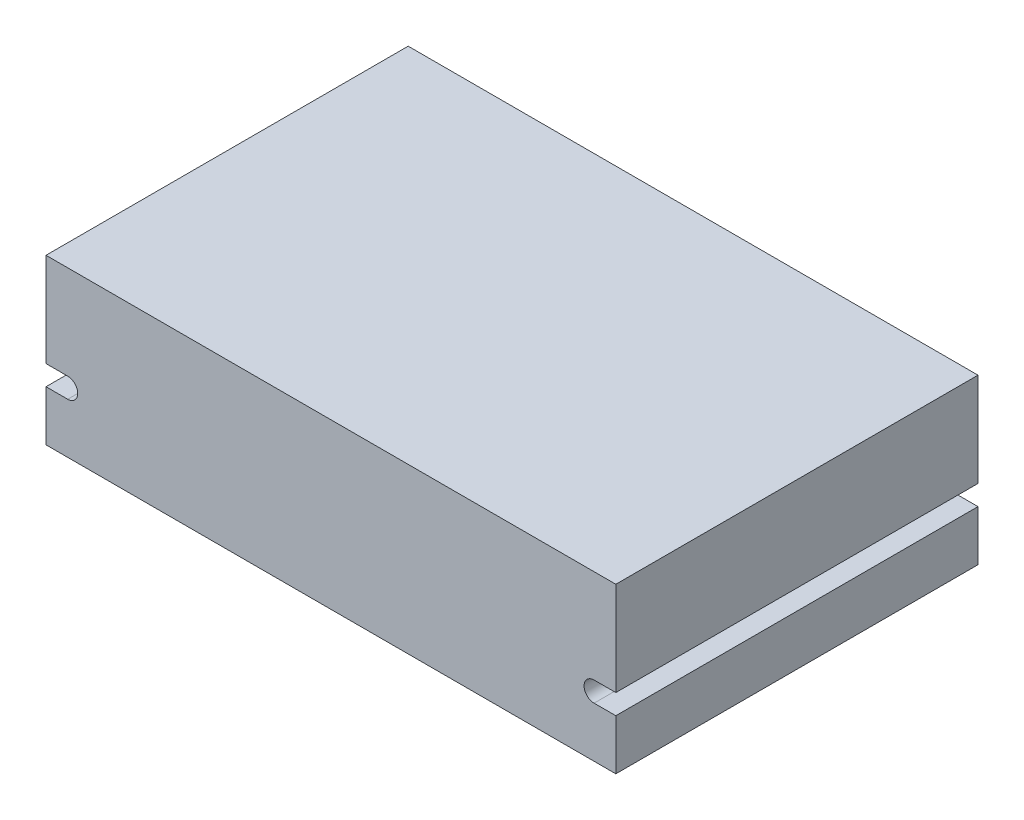
ISO-10303-21;
HEADER;
FILE_DESCRIPTION(('STEP AP214'),'2;1');
FILE_NAME('part.step','',(''),(''),'','','');
FILE_SCHEMA(('AUTOMOTIVE_DESIGN { 1 0 10303 214 1 1 1 1 }'));
ENDSEC;
DATA;
#1=APPLICATION_CONTEXT('core data for automotive mechanical design processes');
#2=APPLICATION_PROTOCOL_DEFINITION('international standard','automotive_design',2000,#1);
#3=PRODUCT_CONTEXT('',#1,'mechanical');
#4=PRODUCT('Part','Part','',(#3));
#5=PRODUCT_RELATED_PRODUCT_CATEGORY('part','',(#4));
#6=PRODUCT_DEFINITION_FORMATION('','',#4);
#7=PRODUCT_DEFINITION_CONTEXT('part definition',#1,'design');
#8=PRODUCT_DEFINITION('design','',#6,#7);
#9=PRODUCT_DEFINITION_SHAPE('','',#8);
#10=(LENGTH_UNIT() NAMED_UNIT(*) SI_UNIT(.MILLI.,.METRE.));
#11=(NAMED_UNIT(*) PLANE_ANGLE_UNIT() SI_UNIT($,.RADIAN.));
#12=(NAMED_UNIT(*) SI_UNIT($,.STERADIAN.) SOLID_ANGLE_UNIT());
#13=UNCERTAINTY_MEASURE_WITH_UNIT(LENGTH_MEASURE(1.E-05),#10,'distance_accuracy_value','');
#14=(GEOMETRIC_REPRESENTATION_CONTEXT(3) GLOBAL_UNCERTAINTY_ASSIGNED_CONTEXT((#13)) GLOBAL_UNIT_ASSIGNED_CONTEXT((#10,
#11,#12)) REPRESENTATION_CONTEXT('',''));
#15=CARTESIAN_POINT('',(0.,0.,0.));
#16=DIRECTION('',(0.,0.,1.));
#17=DIRECTION('',(1.,0.,0.));
#18=AXIS2_PLACEMENT_3D('',#15,#16,#17);
#19=CARTESIAN_POINT('',(-56.75,17.,75.));
#20=DIRECTION('',(1.,0.,0.));
#21=DIRECTION('',(0.,0.,-1.));
#22=AXIS2_PLACEMENT_3D('',#19,#20,#21);
#23=PLANE('',#22);
#24=DIRECTION('',(0.,-1.,0.));
#25=VECTOR('',#24,1.);
#26=CARTESIAN_POINT('',(-56.75,17.,0.));
#27=LINE('',#26,#25);
#28=CARTESIAN_POINT('',(-56.75,17.,0.));
#29=VERTEX_POINT('',#28);
#30=CARTESIAN_POINT('',(-56.75,-2.42677328176177,0.));
#31=VERTEX_POINT('',#30);
#32=EDGE_CURVE('E152',#29,#31,#27,.T.);
#33=ORIENTED_EDGE('',*,*,#32,.T.);
#34=DIRECTION('',(0.,0.,-1.));
#35=VECTOR('',#34,1.);
#36=CARTESIAN_POINT('',(-56.75,-2.42677328176177,75.));
#37=LINE('',#36,#35);
#38=CARTESIAN_POINT('',(-56.75,-2.42677328176177,75.));
#39=VERTEX_POINT('',#38);
#40=EDGE_CURVE('E11',#39,#31,#37,.T.);
#41=ORIENTED_EDGE('',*,*,#40,.F.);
#42=DIRECTION('',(0.,-1.,0.));
#43=VECTOR('',#42,1.);
#44=CARTESIAN_POINT('',(-56.75,17.,75.));
#45=LINE('',#44,#43);
#46=CARTESIAN_POINT('',(-56.75,17.,75.));
#47=VERTEX_POINT('',#46);
#48=EDGE_CURVE('E174',#47,#39,#45,.T.);
#49=ORIENTED_EDGE('',*,*,#48,.F.);
#50=DIRECTION('',(0.,0.,-1.));
#51=VECTOR('',#50,1.);
#52=CARTESIAN_POINT('',(-56.75,17.,75.));
#53=LINE('',#52,#51);
#54=EDGE_CURVE('E148',#47,#29,#53,.T.);
#55=ORIENTED_EDGE('',*,*,#54,.T.);
#56=EDGE_LOOP('',(#33,#41,#49,#55));
#57=FACE_BOUND('',#56,.T.);
#58=ADVANCED_FACE('F32',(#57),#23,.F.);
#59=CARTESIAN_POINT('',(-56.75,-2.42677328176177,75.));
#60=DIRECTION('',(0.,1.,0.));
#61=DIRECTION('',(0.,0.,1.));
#62=AXIS2_PLACEMENT_3D('',#59,#60,#61);
#63=PLANE('',#62);
#64=DIRECTION('',(1.,0.,0.));
#65=VECTOR('',#64,1.);
#66=CARTESIAN_POINT('',(-56.75,-2.42677328176177,0.));
#67=LINE('',#66,#65);
#68=CARTESIAN_POINT('',(-52.25,-2.42677328176177,0.));
#69=VERTEX_POINT('',#68);
#70=EDGE_CURVE('E155',#31,#69,#67,.T.);
#71=ORIENTED_EDGE('',*,*,#70,.T.);
#72=DIRECTION('',(0.,0.,-1.));
#73=VECTOR('',#72,1.);
#74=CARTESIAN_POINT('',(-52.25,-2.42677328176177,75.));
#75=LINE('',#74,#73);
#76=CARTESIAN_POINT('',(-52.25,-2.42677328176177,75.));
#77=VERTEX_POINT('',#76);
#78=EDGE_CURVE('E40',#77,#69,#75,.T.);
#79=ORIENTED_EDGE('',*,*,#78,.F.);
#80=DIRECTION('',(1.,0.,0.));
#81=VECTOR('',#80,1.);
#82=CARTESIAN_POINT('',(-56.75,-2.42677328176177,75.));
#83=LINE('',#82,#81);
#84=EDGE_CURVE('E103',#39,#77,#83,.T.);
#85=ORIENTED_EDGE('',*,*,#84,.F.);
#86=ORIENTED_EDGE('',*,*,#40,.T.);
#87=EDGE_LOOP('',(#71,#79,#85,#86));
#88=FACE_BOUND('',#87,.T.);
#89=ADVANCED_FACE('F252',(#88),#63,.F.);
#90=CARTESIAN_POINT('',(-52.25,-4.49999999999995,75.));
#91=DIRECTION('',(0.,0.,-1.));
#92=DIRECTION('',(-1.,0.,0.));
#93=AXIS2_PLACEMENT_3D('',#90,#91,#92);
#94=CYLINDRICAL_SURFACE('',#93,2.07322671823817);
#95=CARTESIAN_POINT('',(-52.25,-4.49999999999995,0.));
#96=DIRECTION('',(0.,0.,-1.));
#97=DIRECTION('',(1.,0.,0.));
#98=AXIS2_PLACEMENT_3D('',#95,#96,#97);
#99=CIRCLE('',#98,2.07322671823817);
#100=CARTESIAN_POINT('',(-52.25,-6.57322671823812,0.));
#101=VERTEX_POINT('',#100);
#102=EDGE_CURVE('E157',#69,#101,#99,.T.);
#103=ORIENTED_EDGE('',*,*,#102,.T.);
#104=DIRECTION('',(0.,0.,-1.));
#105=VECTOR('',#104,1.);
#106=CARTESIAN_POINT('',(-52.25,-6.57322671823812,75.));
#107=LINE('',#106,#105);
#108=CARTESIAN_POINT('',(-52.25,-6.57322671823812,75.));
#109=VERTEX_POINT('',#108);
#110=EDGE_CURVE('E193',#109,#101,#107,.T.);
#111=ORIENTED_EDGE('',*,*,#110,.F.);
#112=CARTESIAN_POINT('',(-52.25,-4.49999999999995,75.));
#113=DIRECTION('',(0.,0.,-1.));
#114=DIRECTION('',(1.,0.,0.));
#115=AXIS2_PLACEMENT_3D('',#112,#113,#114);
#116=CIRCLE('',#115,2.07322671823817);
#117=EDGE_CURVE('E201',#77,#109,#116,.T.);
#118=ORIENTED_EDGE('',*,*,#117,.F.);
#119=ORIENTED_EDGE('',*,*,#78,.T.);
#120=EDGE_LOOP('',(#103,#111,#118,#119));
#121=FACE_BOUND('',#120,.T.);
#122=ADVANCED_FACE('F199',(#121),#94,.F.);
#123=CARTESIAN_POINT('',(-56.75,-6.57322671823812,75.));
#124=DIRECTION('',(0.,-1.,0.));
#125=DIRECTION('',(0.,0.,-1.));
#126=AXIS2_PLACEMENT_3D('',#123,#124,#125);
#127=PLANE('',#126);
#128=DIRECTION('',(-1.,0.,0.));
#129=VECTOR('',#128,1.);
#130=CARTESIAN_POINT('',(-56.75,-6.57322671823812,0.));
#131=LINE('',#130,#129);
#132=CARTESIAN_POINT('',(-56.75,-6.57322671823812,0.));
#133=VERTEX_POINT('',#132);
#134=EDGE_CURVE('E159',#101,#133,#131,.T.);
#135=ORIENTED_EDGE('',*,*,#134,.T.);
#136=DIRECTION('',(0.,0.,-1.));
#137=VECTOR('',#136,1.);
#138=CARTESIAN_POINT('',(-56.75,-6.57322671823812,75.));
#139=LINE('',#138,#137);
#140=CARTESIAN_POINT('',(-56.75,-6.57322671823812,75.));
#141=VERTEX_POINT('',#140);
#142=EDGE_CURVE('E190',#141,#133,#139,.T.);
#143=ORIENTED_EDGE('',*,*,#142,.F.);
#144=DIRECTION('',(-1.,0.,0.));
#145=VECTOR('',#144,1.);
#146=CARTESIAN_POINT('',(-56.75,-6.57322671823812,75.));
#147=LINE('',#146,#145);
#148=EDGE_CURVE('E219',#109,#141,#147,.T.);
#149=ORIENTED_EDGE('',*,*,#148,.F.);
#150=ORIENTED_EDGE('',*,*,#110,.T.);
#151=EDGE_LOOP('',(#135,#143,#149,#150));
#152=FACE_BOUND('',#151,.T.);
#153=ADVANCED_FACE('F210',(#152),#127,.F.);
#154=CARTESIAN_POINT('',(-56.75,-6.57322671823812,75.));
#155=DIRECTION('',(1.,0.,0.));
#156=DIRECTION('',(0.,0.,-1.));
#157=AXIS2_PLACEMENT_3D('',#154,#155,#156);
#158=PLANE('',#157);
#159=DIRECTION('',(0.,-1.,0.));
#160=VECTOR('',#159,1.);
#161=CARTESIAN_POINT('',(-56.75,-6.57322671823812,0.));
#162=LINE('',#161,#160);
#163=CARTESIAN_POINT('',(-56.75,-17.,0.));
#164=VERTEX_POINT('',#163);
#165=EDGE_CURVE('E161',#133,#164,#162,.T.);
#166=ORIENTED_EDGE('',*,*,#165,.T.);
#167=DIRECTION('',(0.,0.,-1.));
#168=VECTOR('',#167,1.);
#169=CARTESIAN_POINT('',(-56.75,-17.,75.));
#170=LINE('',#169,#168);
#171=CARTESIAN_POINT('',(-56.75,-17.,75.));
#172=VERTEX_POINT('',#171);
#173=EDGE_CURVE('E187',#172,#164,#170,.T.);
#174=ORIENTED_EDGE('',*,*,#173,.F.);
#175=DIRECTION('',(0.,-1.,0.));
#176=VECTOR('',#175,1.);
#177=CARTESIAN_POINT('',(-56.75,-6.57322671823812,75.));
#178=LINE('',#177,#176);
#179=EDGE_CURVE('E216',#141,#172,#178,.T.);
#180=ORIENTED_EDGE('',*,*,#179,.F.);
#181=ORIENTED_EDGE('',*,*,#142,.T.);
#182=EDGE_LOOP('',(#166,#174,#180,#181));
#183=FACE_BOUND('',#182,.T.);
#184=ADVANCED_FACE('F214',(#183),#158,.F.);
#185=CARTESIAN_POINT('',(-56.75,-17.,75.));
#186=DIRECTION('',(0.,1.,0.));
#187=DIRECTION('',(0.,0.,1.));
#188=AXIS2_PLACEMENT_3D('',#185,#186,#187);
#189=PLANE('',#188);
#190=DIRECTION('',(1.,0.,0.));
#191=VECTOR('',#190,1.);
#192=CARTESIAN_POINT('',(-56.75,-17.,0.));
#193=LINE('',#192,#191);
#194=CARTESIAN_POINT('',(61.25,-17.,0.));
#195=VERTEX_POINT('',#194);
#196=EDGE_CURVE('E163',#164,#195,#193,.T.);
#197=ORIENTED_EDGE('',*,*,#196,.T.);
#198=DIRECTION('',(0.,0.,-1.));
#199=VECTOR('',#198,1.);
#200=CARTESIAN_POINT('',(61.25,-17.,75.));
#201=LINE('',#200,#199);
#202=CARTESIAN_POINT('',(61.25,-17.,75.));
#203=VERTEX_POINT('',#202);
#204=EDGE_CURVE('E184',#203,#195,#201,.T.);
#205=ORIENTED_EDGE('',*,*,#204,.F.);
#206=DIRECTION('',(1.,0.,0.));
#207=VECTOR('',#206,1.);
#208=CARTESIAN_POINT('',(-56.75,-17.,75.));
#209=LINE('',#208,#207);
#210=EDGE_CURVE('E218',#172,#203,#209,.T.);
#211=ORIENTED_EDGE('',*,*,#210,.F.);
#212=ORIENTED_EDGE('',*,*,#173,.T.);
#213=EDGE_LOOP('',(#197,#205,#211,#212));
#214=FACE_BOUND('',#213,.T.);
#215=ADVANCED_FACE('F265',(#214),#189,.F.);
#216=CARTESIAN_POINT('',(61.25,-6.57322671823812,75.));
#217=DIRECTION('',(-1.,0.,0.));
#218=DIRECTION('',(0.,0.,1.));
#219=AXIS2_PLACEMENT_3D('',#216,#217,#218);
#220=PLANE('',#219);
#221=DIRECTION('',(0.,1.,0.));
#222=VECTOR('',#221,1.);
#223=CARTESIAN_POINT('',(61.25,-6.57322671823812,0.));
#224=LINE('',#223,#222);
#225=CARTESIAN_POINT('',(61.25,-6.57322671823812,0.));
#226=VERTEX_POINT('',#225);
#227=EDGE_CURVE('E165',#195,#226,#224,.T.);
#228=ORIENTED_EDGE('',*,*,#227,.T.);
#229=DIRECTION('',(0.,0.,-1.));
#230=VECTOR('',#229,1.);
#231=CARTESIAN_POINT('',(61.25,-6.57322671823812,75.));
#232=LINE('',#231,#230);
#233=CARTESIAN_POINT('',(61.25,-6.57322671823812,75.));
#234=VERTEX_POINT('',#233);
#235=EDGE_CURVE('E181',#234,#226,#232,.T.);
#236=ORIENTED_EDGE('',*,*,#235,.F.);
#237=DIRECTION('',(0.,1.,0.));
#238=VECTOR('',#237,1.);
#239=CARTESIAN_POINT('',(61.25,-6.57322671823812,75.));
#240=LINE('',#239,#238);
#241=EDGE_CURVE('E221',#203,#234,#240,.T.);
#242=ORIENTED_EDGE('',*,*,#241,.F.);
#243=ORIENTED_EDGE('',*,*,#204,.T.);
#244=EDGE_LOOP('',(#228,#236,#242,#243));
#245=FACE_BOUND('',#244,.T.);
#246=ADVANCED_FACE('F268',(#245),#220,.F.);
#247=CARTESIAN_POINT('',(61.25,-6.57322671823812,75.));
#248=DIRECTION('',(0.,-1.,0.));
#249=DIRECTION('',(0.,0.,-1.));
#250=AXIS2_PLACEMENT_3D('',#247,#248,#249);
#251=PLANE('',#250);
#252=DIRECTION('',(-1.,0.,0.));
#253=VECTOR('',#252,1.);
#254=CARTESIAN_POINT('',(61.25,-6.57322671823812,0.));
#255=LINE('',#254,#253);
#256=CARTESIAN_POINT('',(56.75,-6.57322671823812,0.));
#257=VERTEX_POINT('',#256);
#258=EDGE_CURVE('E167',#226,#257,#255,.T.);
#259=ORIENTED_EDGE('',*,*,#258,.T.);
#260=DIRECTION('',(0.,0.,-1.));
#261=VECTOR('',#260,1.);
#262=CARTESIAN_POINT('',(56.75,-6.57322671823812,75.));
#263=LINE('',#262,#261);
#264=CARTESIAN_POINT('',(56.75,-6.57322671823812,75.));
#265=VERTEX_POINT('',#264);
#266=EDGE_CURVE('E178',#265,#257,#263,.T.);
#267=ORIENTED_EDGE('',*,*,#266,.F.);
#268=DIRECTION('',(-1.,0.,0.));
#269=VECTOR('',#268,1.);
#270=CARTESIAN_POINT('',(61.25,-6.57322671823812,75.));
#271=LINE('',#270,#269);
#272=EDGE_CURVE('E227',#234,#265,#271,.T.);
#273=ORIENTED_EDGE('',*,*,#272,.F.);
#274=ORIENTED_EDGE('',*,*,#235,.T.);
#275=EDGE_LOOP('',(#259,#267,#273,#274));
#276=FACE_BOUND('',#275,.T.);
#277=ADVANCED_FACE('F233',(#276),#251,.F.);
#278=CARTESIAN_POINT('',(56.75,-4.49999999999995,75.));
#279=DIRECTION('',(0.,0.,-1.));
#280=DIRECTION('',(-1.,0.,0.));
#281=AXIS2_PLACEMENT_3D('',#278,#279,#280);
#282=CYLINDRICAL_SURFACE('',#281,2.07322671823817);
#283=CARTESIAN_POINT('',(56.75,-4.49999999999995,0.));
#284=DIRECTION('',(0.,0.,-1.));
#285=DIRECTION('',(-1.,0.,0.));
#286=AXIS2_PLACEMENT_3D('',#283,#284,#285);
#287=CIRCLE('',#286,2.07322671823817);
#288=CARTESIAN_POINT('',(56.75,-2.42677328176177,0.));
#289=VERTEX_POINT('',#288);
#290=EDGE_CURVE('E169',#257,#289,#287,.T.);
#291=ORIENTED_EDGE('',*,*,#290,.T.);
#292=DIRECTION('',(0.,0.,-1.));
#293=VECTOR('',#292,1.);
#294=CARTESIAN_POINT('',(56.75,-2.42677328176177,75.));
#295=LINE('',#294,#293);
#296=CARTESIAN_POINT('',(56.75,-2.42677328176177,75.));
#297=VERTEX_POINT('',#296);
#298=EDGE_CURVE('E143',#297,#289,#295,.T.);
#299=ORIENTED_EDGE('',*,*,#298,.F.);
#300=CARTESIAN_POINT('',(56.75,-4.49999999999995,75.));
#301=DIRECTION('',(0.,0.,-1.));
#302=DIRECTION('',(-1.,0.,0.));
#303=AXIS2_PLACEMENT_3D('',#300,#301,#302);
#304=CIRCLE('',#303,2.07322671823817);
#305=EDGE_CURVE('E134',#265,#297,#304,.T.);
#306=ORIENTED_EDGE('',*,*,#305,.F.);
#307=ORIENTED_EDGE('',*,*,#266,.T.);
#308=EDGE_LOOP('',(#291,#299,#306,#307));
#309=FACE_BOUND('',#308,.T.);
#310=ADVANCED_FACE('F237',(#309),#282,.F.);
#311=CARTESIAN_POINT('',(61.25,-2.42677328176177,75.));
#312=DIRECTION('',(0.,1.,0.));
#313=DIRECTION('',(0.,0.,1.));
#314=AXIS2_PLACEMENT_3D('',#311,#312,#313);
#315=PLANE('',#314);
#316=DIRECTION('',(1.,0.,0.));
#317=VECTOR('',#316,1.);
#318=CARTESIAN_POINT('',(61.25,-2.42677328176177,0.));
#319=LINE('',#318,#317);
#320=CARTESIAN_POINT('',(61.25,-2.42677328176177,0.));
#321=VERTEX_POINT('',#320);
#322=EDGE_CURVE('E142',#289,#321,#319,.T.);
#323=ORIENTED_EDGE('',*,*,#322,.T.);
#324=DIRECTION('',(0.,0.,-1.));
#325=VECTOR('',#324,1.);
#326=CARTESIAN_POINT('',(61.25,-2.42677328176177,75.));
#327=LINE('',#326,#325);
#328=CARTESIAN_POINT('',(61.25,-2.42677328176177,75.));
#329=VERTEX_POINT('',#328);
#330=EDGE_CURVE('E139',#329,#321,#327,.T.);
#331=ORIENTED_EDGE('',*,*,#330,.F.);
#332=DIRECTION('',(1.,0.,0.));
#333=VECTOR('',#332,1.);
#334=CARTESIAN_POINT('',(61.25,-2.42677328176177,75.));
#335=LINE('',#334,#333);
#336=EDGE_CURVE('E128',#297,#329,#335,.T.);
#337=ORIENTED_EDGE('',*,*,#336,.F.);
#338=ORIENTED_EDGE('',*,*,#298,.T.);
#339=EDGE_LOOP('',(#323,#331,#337,#338));
#340=FACE_BOUND('',#339,.T.);
#341=ADVANCED_FACE('F140',(#340),#315,.F.);
#342=CARTESIAN_POINT('',(61.25,17.,75.));
#343=DIRECTION('',(-1.,0.,0.));
#344=DIRECTION('',(0.,0.,1.));
#345=AXIS2_PLACEMENT_3D('',#342,#343,#344);
#346=PLANE('',#345);
#347=DIRECTION('',(0.,1.,0.));
#348=VECTOR('',#347,1.);
#349=CARTESIAN_POINT('',(61.25,17.,0.));
#350=LINE('',#349,#348);
#351=CARTESIAN_POINT('',(61.25,17.,0.));
#352=VERTEX_POINT('',#351);
#353=EDGE_CURVE('E89',#321,#352,#350,.T.);
#354=ORIENTED_EDGE('',*,*,#353,.T.);
#355=DIRECTION('',(0.,0.,-1.));
#356=VECTOR('',#355,1.);
#357=CARTESIAN_POINT('',(61.25,17.,75.));
#358=LINE('',#357,#356);
#359=CARTESIAN_POINT('',(61.25,17.,75.));
#360=VERTEX_POINT('',#359);
#361=EDGE_CURVE('E144',#360,#352,#358,.T.);
#362=ORIENTED_EDGE('',*,*,#361,.F.);
#363=DIRECTION('',(0.,1.,0.));
#364=VECTOR('',#363,1.);
#365=CARTESIAN_POINT('',(61.25,17.,75.));
#366=LINE('',#365,#364);
#367=EDGE_CURVE('E132',#329,#360,#366,.T.);
#368=ORIENTED_EDGE('',*,*,#367,.F.);
#369=ORIENTED_EDGE('',*,*,#330,.T.);
#370=EDGE_LOOP('',(#354,#362,#368,#369));
#371=FACE_BOUND('',#370,.T.);
#372=ADVANCED_FACE('F146',(#371),#346,.F.);
#373=CARTESIAN_POINT('',(-56.75,17.,75.));
#374=DIRECTION('',(0.,-1.,0.));
#375=DIRECTION('',(0.,0.,-1.));
#376=AXIS2_PLACEMENT_3D('',#373,#374,#375);
#377=PLANE('',#376);
#378=DIRECTION('',(-1.,0.,0.));
#379=VECTOR('',#378,1.);
#380=CARTESIAN_POINT('',(-56.75,17.,0.));
#381=LINE('',#380,#379);
#382=EDGE_CURVE('E95',#352,#29,#381,.T.);
#383=ORIENTED_EDGE('',*,*,#382,.T.);
#384=ORIENTED_EDGE('',*,*,#54,.F.);
#385=DIRECTION('',(-1.,0.,0.));
#386=VECTOR('',#385,1.);
#387=CARTESIAN_POINT('',(-56.75,17.,75.));
#388=LINE('',#387,#386);
#389=EDGE_CURVE('E48',#360,#47,#388,.T.);
#390=ORIENTED_EDGE('',*,*,#389,.F.);
#391=ORIENTED_EDGE('',*,*,#361,.T.);
#392=EDGE_LOOP('',(#383,#384,#390,#391));
#393=FACE_BOUND('',#392,.T.);
#394=ADVANCED_FACE('F241',(#393),#377,.F.);
#395=CARTESIAN_POINT('',(-52.25,-4.49999999999995,75.));
#396=DIRECTION('',(0.,0.,1.));
#397=DIRECTION('',(1.,0.,0.));
#398=AXIS2_PLACEMENT_3D('',#395,#396,#397);
#399=PLANE('',#398);
#400=ORIENTED_EDGE('',*,*,#48,.T.);
#401=ORIENTED_EDGE('',*,*,#84,.T.);
#402=ORIENTED_EDGE('',*,*,#117,.T.);
#403=ORIENTED_EDGE('',*,*,#148,.T.);
#404=ORIENTED_EDGE('',*,*,#179,.T.);
#405=ORIENTED_EDGE('',*,*,#210,.T.);
#406=ORIENTED_EDGE('',*,*,#241,.T.);
#407=ORIENTED_EDGE('',*,*,#272,.T.);
#408=ORIENTED_EDGE('',*,*,#305,.T.);
#409=ORIENTED_EDGE('',*,*,#336,.T.);
#410=ORIENTED_EDGE('',*,*,#367,.T.);
#411=ORIENTED_EDGE('',*,*,#389,.T.);
#412=EDGE_LOOP('',(#400,#401,#402,#403,#404,#405,#406,#407,#408,#409,#410,#411));
#413=FACE_BOUND('',#412,.T.);
#414=ADVANCED_FACE('F130',(#413),#399,.T.);
#415=CARTESIAN_POINT('',(-52.25,-4.49999999999995,0.));
#416=DIRECTION('',(0.,0.,1.));
#417=DIRECTION('',(1.,0.,0.));
#418=AXIS2_PLACEMENT_3D('',#415,#416,#417);
#419=PLANE('',#418);
#420=ORIENTED_EDGE('',*,*,#32,.F.);
#421=ORIENTED_EDGE('',*,*,#382,.F.);
#422=ORIENTED_EDGE('',*,*,#353,.F.);
#423=ORIENTED_EDGE('',*,*,#322,.F.);
#424=ORIENTED_EDGE('',*,*,#290,.F.);
#425=ORIENTED_EDGE('',*,*,#258,.F.);
#426=ORIENTED_EDGE('',*,*,#227,.F.);
#427=ORIENTED_EDGE('',*,*,#196,.F.);
#428=ORIENTED_EDGE('',*,*,#165,.F.);
#429=ORIENTED_EDGE('',*,*,#134,.F.);
#430=ORIENTED_EDGE('',*,*,#102,.F.);
#431=ORIENTED_EDGE('',*,*,#70,.F.);
#432=EDGE_LOOP('',(#420,#421,#422,#423,#424,#425,#426,#427,#428,#429,#430,#431));
#433=FACE_BOUND('',#432,.T.);
#434=ADVANCED_FACE('F205',(#433),#419,.F.);
#435=CLOSED_SHELL('',(#58,#89,#122,#153,#184,#215,#246,#277,#310,#341,#372,#394,#414,#434));
#436=MANIFOLD_SOLID_BREP('B2',#435);
#437=ADVANCED_BREP_SHAPE_REPRESENTATION('',(#18,#436),#14);
#438=SHAPE_DEFINITION_REPRESENTATION(#9,#437);
ENDSEC;
END-ISO-10303-21;
